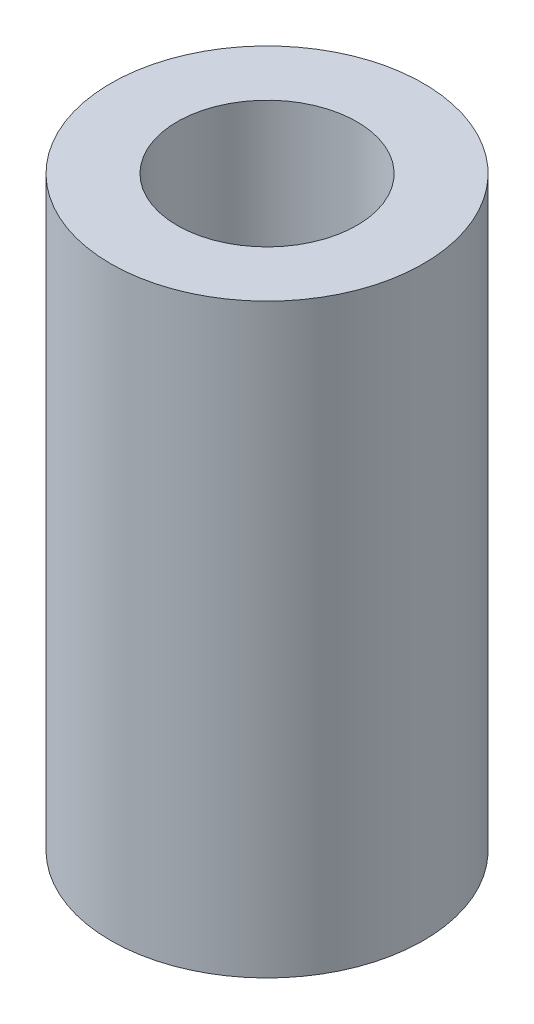
ISO-10303-21;
HEADER;
FILE_DESCRIPTION(('STEP AP214'),'2;1');
FILE_NAME('part.step','',(''),(''),'','','');
FILE_SCHEMA(('AUTOMOTIVE_DESIGN { 1 0 10303 214 1 1 1 1 }'));
ENDSEC;
DATA;
#1=APPLICATION_CONTEXT('core data for automotive mechanical design processes');
#2=APPLICATION_PROTOCOL_DEFINITION('international standard','automotive_design',2000,#1);
#3=PRODUCT_CONTEXT('',#1,'mechanical');
#4=PRODUCT('Part','Part','',(#3));
#5=PRODUCT_RELATED_PRODUCT_CATEGORY('part','',(#4));
#6=PRODUCT_DEFINITION_FORMATION('','',#4);
#7=PRODUCT_DEFINITION_CONTEXT('part definition',#1,'design');
#8=PRODUCT_DEFINITION('design','',#6,#7);
#9=PRODUCT_DEFINITION_SHAPE('','',#8);
#10=(LENGTH_UNIT() NAMED_UNIT(*) SI_UNIT(.MILLI.,.METRE.));
#11=(NAMED_UNIT(*) PLANE_ANGLE_UNIT() SI_UNIT($,.RADIAN.));
#12=(NAMED_UNIT(*) SI_UNIT($,.STERADIAN.) SOLID_ANGLE_UNIT());
#13=UNCERTAINTY_MEASURE_WITH_UNIT(LENGTH_MEASURE(1.E-05),#10,'distance_accuracy_value','');
#14=(GEOMETRIC_REPRESENTATION_CONTEXT(3) GLOBAL_UNCERTAINTY_ASSIGNED_CONTEXT((#13)) GLOBAL_UNIT_ASSIGNED_CONTEXT((#10,
#11,#12)) REPRESENTATION_CONTEXT('',''));
#15=CARTESIAN_POINT('',(0.,0.,0.));
#16=DIRECTION('',(0.,0.,1.));
#17=DIRECTION('',(1.,0.,0.));
#18=AXIS2_PLACEMENT_3D('',#15,#16,#17);
#19=CARTESIAN_POINT('',(0.,15.,0.));
#20=DIRECTION('',(0.,1.,0.));
#21=DIRECTION('',(0.,0.,1.));
#22=AXIS2_PLACEMENT_3D('',#19,#20,#21);
#23=PLANE('',#22);
#24=CARTESIAN_POINT('',(0.,15.,0.));
#25=DIRECTION('',(0.,1.,0.));
#26=DIRECTION('',(0.,0.,1.));
#27=AXIS2_PLACEMENT_3D('',#24,#25,#26);
#28=CIRCLE('',#27,4.);
#29=CARTESIAN_POINT('',(0.,15.,4.));
#30=VERTEX_POINT('',#29);
#31=EDGE_CURVE('E10',#30,#30,#28,.T.);
#32=ORIENTED_EDGE('',*,*,#31,.T.);
#33=EDGE_LOOP('',(#32));
#34=FACE_BOUND('',#33,.T.);
#35=CARTESIAN_POINT('',(0.,15.,0.));
#36=DIRECTION('',(0.,1.,0.));
#37=DIRECTION('',(0.,0.,1.));
#38=AXIS2_PLACEMENT_3D('',#35,#36,#37);
#39=CIRCLE('',#38,2.3);
#40=CARTESIAN_POINT('',(0.,15.,2.3));
#41=VERTEX_POINT('',#40);
#42=EDGE_CURVE('E44',#41,#41,#39,.T.);
#43=ORIENTED_EDGE('',*,*,#42,.F.);
#44=EDGE_LOOP('',(#43));
#45=FACE_BOUND('',#44,.T.);
#46=ADVANCED_FACE('F33',(#34,#45),#23,.T.);
#47=CARTESIAN_POINT('',(0.,0.,0.));
#48=DIRECTION('',(0.,1.,0.));
#49=DIRECTION('',(0.,0.,1.));
#50=AXIS2_PLACEMENT_3D('',#47,#48,#49);
#51=PLANE('',#50);
#52=CARTESIAN_POINT('',(0.,0.,0.));
#53=DIRECTION('',(0.,1.,0.));
#54=DIRECTION('',(0.,0.,1.));
#55=AXIS2_PLACEMENT_3D('',#52,#53,#54);
#56=CIRCLE('',#55,4.);
#57=CARTESIAN_POINT('',(0.,0.,4.));
#58=VERTEX_POINT('',#57);
#59=EDGE_CURVE('E37',#58,#58,#56,.T.);
#60=ORIENTED_EDGE('',*,*,#59,.F.);
#61=EDGE_LOOP('',(#60));
#62=FACE_BOUND('',#61,.T.);
#63=CARTESIAN_POINT('',(0.,0.,0.));
#64=DIRECTION('',(0.,1.,0.));
#65=DIRECTION('',(0.,0.,1.));
#66=AXIS2_PLACEMENT_3D('',#63,#64,#65);
#67=CIRCLE('',#66,2.3);
#68=CARTESIAN_POINT('',(0.,0.,2.3));
#69=VERTEX_POINT('',#68);
#70=EDGE_CURVE('E46',#69,#69,#67,.T.);
#71=ORIENTED_EDGE('',*,*,#70,.T.);
#72=EDGE_LOOP('',(#71));
#73=FACE_BOUND('',#72,.T.);
#74=ADVANCED_FACE('F56',(#62,#73),#51,.F.);
#75=CARTESIAN_POINT('',(0.,15.,0.));
#76=DIRECTION('',(0.,-1.,0.));
#77=DIRECTION('',(0.,0.,-1.));
#78=AXIS2_PLACEMENT_3D('',#75,#76,#77);
#79=CYLINDRICAL_SURFACE('',#78,4.);
#80=ORIENTED_EDGE('',*,*,#31,.F.);
#81=EDGE_LOOP('',(#80));
#82=FACE_BOUND('',#81,.T.);
#83=ORIENTED_EDGE('',*,*,#59,.T.);
#84=EDGE_LOOP('',(#83));
#85=FACE_BOUND('',#84,.T.);
#86=ADVANCED_FACE('F35',(#82,#85),#79,.T.);
#87=CARTESIAN_POINT('',(0.,15.,0.));
#88=DIRECTION('',(0.,-1.,0.));
#89=DIRECTION('',(0.,0.,-1.));
#90=AXIS2_PLACEMENT_3D('',#87,#88,#89);
#91=CYLINDRICAL_SURFACE('',#90,2.3);
#92=ORIENTED_EDGE('',*,*,#42,.T.);
#93=EDGE_LOOP('',(#92));
#94=FACE_BOUND('',#93,.T.);
#95=ORIENTED_EDGE('',*,*,#70,.F.);
#96=EDGE_LOOP('',(#95));
#97=FACE_BOUND('',#96,.T.);
#98=ADVANCED_FACE('F52',(#94,#97),#91,.F.);
#99=CLOSED_SHELL('',(#46,#74,#86,#98));
#100=MANIFOLD_SOLID_BREP('B2',#99);
#101=ADVANCED_BREP_SHAPE_REPRESENTATION('',(#18,#100),#14);
#102=SHAPE_DEFINITION_REPRESENTATION(#9,#101);
ENDSEC;
END-ISO-10303-21;
